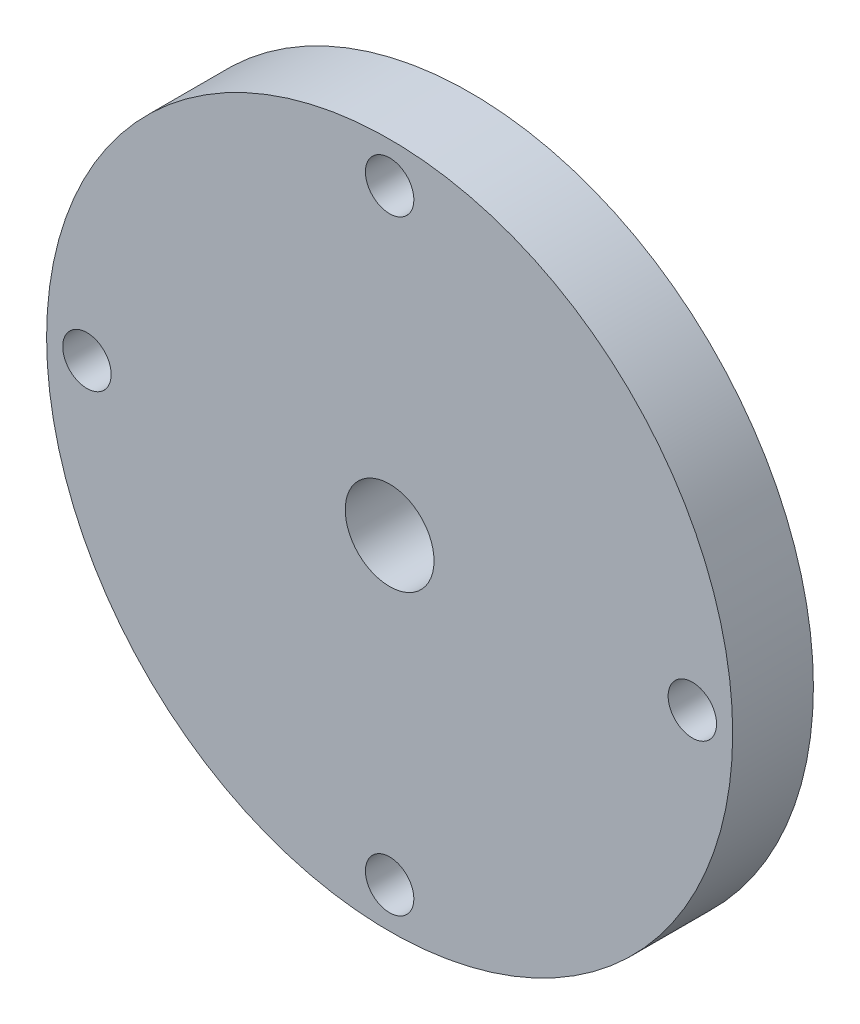
ISO-10303-21;
HEADER;
FILE_DESCRIPTION(('STEP AP214'),'2;1');
FILE_NAME('part.step','',(''),(''),'','','');
FILE_SCHEMA(('AUTOMOTIVE_DESIGN { 1 0 10303 214 1 1 1 1 }'));
ENDSEC;
DATA;
#1=APPLICATION_CONTEXT('core data for automotive mechanical design processes');
#2=APPLICATION_PROTOCOL_DEFINITION('international standard','automotive_design',2000,#1);
#3=PRODUCT_CONTEXT('',#1,'mechanical');
#4=PRODUCT('Part','Part','',(#3));
#5=PRODUCT_RELATED_PRODUCT_CATEGORY('part','',(#4));
#6=PRODUCT_DEFINITION_FORMATION('','',#4);
#7=PRODUCT_DEFINITION_CONTEXT('part definition',#1,'design');
#8=PRODUCT_DEFINITION('design','',#6,#7);
#9=PRODUCT_DEFINITION_SHAPE('','',#8);
#10=(LENGTH_UNIT() NAMED_UNIT(*) SI_UNIT(.MILLI.,.METRE.));
#11=(NAMED_UNIT(*) PLANE_ANGLE_UNIT() SI_UNIT($,.RADIAN.));
#12=(NAMED_UNIT(*) SI_UNIT($,.STERADIAN.) SOLID_ANGLE_UNIT());
#13=UNCERTAINTY_MEASURE_WITH_UNIT(LENGTH_MEASURE(1.E-05),#10,'distance_accuracy_value','');
#14=(GEOMETRIC_REPRESENTATION_CONTEXT(3) GLOBAL_UNCERTAINTY_ASSIGNED_CONTEXT((#13)) GLOBAL_UNIT_ASSIGNED_CONTEXT((#10,
#11,#12)) REPRESENTATION_CONTEXT('',''));
#15=CARTESIAN_POINT('',(0.,0.,0.));
#16=DIRECTION('',(0.,0.,1.));
#17=DIRECTION('',(1.,0.,0.));
#18=AXIS2_PLACEMENT_3D('',#15,#16,#17);
#19=CARTESIAN_POINT('',(0.,0.,1.));
#20=DIRECTION('',(0.,0.,1.));
#21=DIRECTION('',(1.,0.,0.));
#22=AXIS2_PLACEMENT_3D('',#19,#20,#21);
#23=PLANE('',#22);
#24=CARTESIAN_POINT('',(2.1224433562867E-13,-3.75,1.));
#25=DIRECTION('',(0.,0.,1.));
#26=DIRECTION('',(1.,0.,0.));
#27=AXIS2_PLACEMENT_3D('',#24,#25,#26);
#28=CIRCLE('',#27,0.300000000000228);
#29=CARTESIAN_POINT('',(0.30000000000044,-3.75,1.));
#30=VERTEX_POINT('',#29);
#31=EDGE_CURVE('E59',#30,#30,#28,.T.);
#32=ORIENTED_EDGE('',*,*,#31,.F.);
#33=EDGE_LOOP('',(#32));
#34=FACE_BOUND('',#33,.T.);
#35=CARTESIAN_POINT('',(0.,0.,1.));
#36=DIRECTION('',(0.,0.,1.));
#37=DIRECTION('',(1.,0.,0.));
#38=AXIS2_PLACEMENT_3D('',#35,#36,#37);
#39=CIRCLE('',#38,0.55);
#40=CARTESIAN_POINT('',(0.55,0.,1.));
#41=VERTEX_POINT('',#40);
#42=EDGE_CURVE('E47',#41,#41,#39,.T.);
#43=ORIENTED_EDGE('',*,*,#42,.F.);
#44=EDGE_LOOP('',(#43));
#45=FACE_BOUND('',#44,.T.);
#46=CARTESIAN_POINT('',(0.,0.,1.));
#47=DIRECTION('',(0.,0.,1.));
#48=DIRECTION('',(1.,0.,0.));
#49=AXIS2_PLACEMENT_3D('',#46,#47,#48);
#50=CIRCLE('',#49,4.25);
#51=CARTESIAN_POINT('',(4.25,0.,1.));
#52=VERTEX_POINT('',#51);
#53=EDGE_CURVE('E10',#52,#52,#50,.T.);
#54=ORIENTED_EDGE('',*,*,#53,.T.);
#55=EDGE_LOOP('',(#54));
#56=FACE_BOUND('',#55,.T.);
#57=CARTESIAN_POINT('',(0.,3.75,1.));
#58=DIRECTION('',(0.,0.,1.));
#59=DIRECTION('',(1.,0.,0.));
#60=AXIS2_PLACEMENT_3D('',#57,#58,#59);
#61=CIRCLE('',#60,0.3);
#62=CARTESIAN_POINT('',(0.3,3.75,1.));
#63=VERTEX_POINT('',#62);
#64=EDGE_CURVE('E42',#63,#63,#61,.T.);
#65=ORIENTED_EDGE('',*,*,#64,.F.);
#66=EDGE_LOOP('',(#65));
#67=FACE_BOUND('',#66,.T.);
#68=CARTESIAN_POINT('',(3.75000000000011,1.06122167814335E-13,1.));
#69=DIRECTION('',(0.,0.,1.));
#70=DIRECTION('',(1.,0.,0.));
#71=AXIS2_PLACEMENT_3D('',#68,#69,#70);
#72=CIRCLE('',#71,0.300000000000083);
#73=CARTESIAN_POINT('',(4.05000000000019,1.06122167814335E-13,1.));
#74=VERTEX_POINT('',#73);
#75=EDGE_CURVE('E53',#74,#74,#72,.T.);
#76=ORIENTED_EDGE('',*,*,#75,.F.);
#77=EDGE_LOOP('',(#76));
#78=FACE_BOUND('',#77,.T.);
#79=CARTESIAN_POINT('',(-3.74999999999989,-1.06581410364015E-13,1.));
#80=DIRECTION('',(0.,0.,1.));
#81=DIRECTION('',(1.,0.,0.));
#82=AXIS2_PLACEMENT_3D('',#79,#80,#81);
#83=CIRCLE('',#82,0.300000000000171);
#84=CARTESIAN_POINT('',(-3.44999999999972,-1.06581410364015E-13,1.));
#85=VERTEX_POINT('',#84);
#86=EDGE_CURVE('E65',#85,#85,#83,.T.);
#87=ORIENTED_EDGE('',*,*,#86,.F.);
#88=EDGE_LOOP('',(#87));
#89=FACE_BOUND('',#88,.T.);
#90=ADVANCED_FACE('F31',(#34,#45,#56,#67,#78,#89),#23,.T.);
#91=CARTESIAN_POINT('',(0.,0.,0.));
#92=DIRECTION('',(0.,0.,1.));
#93=DIRECTION('',(1.,0.,0.));
#94=AXIS2_PLACEMENT_3D('',#91,#92,#93);
#95=PLANE('',#94);
#96=CARTESIAN_POINT('',(2.1224433562867E-13,-3.75,0.));
#97=DIRECTION('',(0.,0.,1.));
#98=DIRECTION('',(1.,0.,0.));
#99=AXIS2_PLACEMENT_3D('',#96,#97,#98);
#100=CIRCLE('',#99,0.300000000000228);
#101=CARTESIAN_POINT('',(0.30000000000044,-3.75,0.));
#102=VERTEX_POINT('',#101);
#103=EDGE_CURVE('E62',#102,#102,#100,.T.);
#104=ORIENTED_EDGE('',*,*,#103,.T.);
#105=EDGE_LOOP('',(#104));
#106=FACE_BOUND('',#105,.T.);
#107=CARTESIAN_POINT('',(0.,0.,0.));
#108=DIRECTION('',(0.,0.,1.));
#109=DIRECTION('',(1.,0.,0.));
#110=AXIS2_PLACEMENT_3D('',#107,#108,#109);
#111=CIRCLE('',#110,0.55);
#112=CARTESIAN_POINT('',(0.55,0.,0.));
#113=VERTEX_POINT('',#112);
#114=EDGE_CURVE('E50',#113,#113,#111,.T.);
#115=ORIENTED_EDGE('',*,*,#114,.T.);
#116=EDGE_LOOP('',(#115));
#117=FACE_BOUND('',#116,.T.);
#118=CARTESIAN_POINT('',(0.,0.,0.));
#119=DIRECTION('',(0.,0.,1.));
#120=DIRECTION('',(1.,0.,0.));
#121=AXIS2_PLACEMENT_3D('',#118,#119,#120);
#122=CIRCLE('',#121,4.25);
#123=CARTESIAN_POINT('',(4.25,0.,0.));
#124=VERTEX_POINT('',#123);
#125=EDGE_CURVE('E35',#124,#124,#122,.T.);
#126=ORIENTED_EDGE('',*,*,#125,.F.);
#127=EDGE_LOOP('',(#126));
#128=FACE_BOUND('',#127,.T.);
#129=CARTESIAN_POINT('',(0.,3.75,0.));
#130=DIRECTION('',(0.,0.,1.));
#131=DIRECTION('',(1.,0.,0.));
#132=AXIS2_PLACEMENT_3D('',#129,#130,#131);
#133=CIRCLE('',#132,0.3);
#134=CARTESIAN_POINT('',(0.3,3.75,0.));
#135=VERTEX_POINT('',#134);
#136=EDGE_CURVE('E44',#135,#135,#133,.T.);
#137=ORIENTED_EDGE('',*,*,#136,.T.);
#138=EDGE_LOOP('',(#137));
#139=FACE_BOUND('',#138,.T.);
#140=CARTESIAN_POINT('',(3.75000000000011,1.06122167814335E-13,0.));
#141=DIRECTION('',(0.,0.,1.));
#142=DIRECTION('',(1.,0.,0.));
#143=AXIS2_PLACEMENT_3D('',#140,#141,#142);
#144=CIRCLE('',#143,0.300000000000083);
#145=CARTESIAN_POINT('',(4.05000000000019,1.06122167814335E-13,0.));
#146=VERTEX_POINT('',#145);
#147=EDGE_CURVE('E56',#146,#146,#144,.T.);
#148=ORIENTED_EDGE('',*,*,#147,.T.);
#149=EDGE_LOOP('',(#148));
#150=FACE_BOUND('',#149,.T.);
#151=CARTESIAN_POINT('',(-3.74999999999989,-1.06581410364015E-13,0.));
#152=DIRECTION('',(0.,0.,1.));
#153=DIRECTION('',(1.,0.,0.));
#154=AXIS2_PLACEMENT_3D('',#151,#152,#153);
#155=CIRCLE('',#154,0.300000000000171);
#156=CARTESIAN_POINT('',(-3.44999999999972,-1.06581410364015E-13,0.));
#157=VERTEX_POINT('',#156);
#158=EDGE_CURVE('E68',#157,#157,#155,.T.);
#159=ORIENTED_EDGE('',*,*,#158,.T.);
#160=EDGE_LOOP('',(#159));
#161=FACE_BOUND('',#160,.T.);
#162=ADVANCED_FACE('F78',(#106,#117,#128,#139,#150,#161),#95,.F.);
#163=CARTESIAN_POINT('',(0.,0.,1.));
#164=DIRECTION('',(0.,0.,-1.));
#165=DIRECTION('',(-1.,0.,0.));
#166=AXIS2_PLACEMENT_3D('',#163,#164,#165);
#167=CYLINDRICAL_SURFACE('',#166,4.25);
#168=ORIENTED_EDGE('',*,*,#53,.F.);
#169=EDGE_LOOP('',(#168));
#170=FACE_BOUND('',#169,.T.);
#171=ORIENTED_EDGE('',*,*,#125,.T.);
#172=EDGE_LOOP('',(#171));
#173=FACE_BOUND('',#172,.T.);
#174=ADVANCED_FACE('F33',(#170,#173),#167,.T.);
#175=CARTESIAN_POINT('',(0.,3.75,1.));
#176=DIRECTION('',(0.,0.,-1.));
#177=DIRECTION('',(-1.,0.,0.));
#178=AXIS2_PLACEMENT_3D('',#175,#176,#177);
#179=CYLINDRICAL_SURFACE('',#178,0.3);
#180=ORIENTED_EDGE('',*,*,#64,.T.);
#181=EDGE_LOOP('',(#180));
#182=FACE_BOUND('',#181,.T.);
#183=ORIENTED_EDGE('',*,*,#136,.F.);
#184=EDGE_LOOP('',(#183));
#185=FACE_BOUND('',#184,.T.);
#186=ADVANCED_FACE('F88',(#182,#185),#179,.F.);
#187=CARTESIAN_POINT('',(0.,0.,1.));
#188=DIRECTION('',(0.,0.,-1.));
#189=DIRECTION('',(-1.,0.,0.));
#190=AXIS2_PLACEMENT_3D('',#187,#188,#189);
#191=CYLINDRICAL_SURFACE('',#190,0.55);
#192=ORIENTED_EDGE('',*,*,#42,.T.);
#193=EDGE_LOOP('',(#192));
#194=FACE_BOUND('',#193,.T.);
#195=ORIENTED_EDGE('',*,*,#114,.F.);
#196=EDGE_LOOP('',(#195));
#197=FACE_BOUND('',#196,.T.);
#198=ADVANCED_FACE('F91',(#194,#197),#191,.F.);
#199=CARTESIAN_POINT('',(3.75000000000011,1.06122167814335E-13,1.));
#200=DIRECTION('',(0.,0.,-1.));
#201=DIRECTION('',(-1.,0.,0.));
#202=AXIS2_PLACEMENT_3D('',#199,#200,#201);
#203=CYLINDRICAL_SURFACE('',#202,0.300000000000083);
#204=ORIENTED_EDGE('',*,*,#75,.T.);
#205=EDGE_LOOP('',(#204));
#206=FACE_BOUND('',#205,.T.);
#207=ORIENTED_EDGE('',*,*,#147,.F.);
#208=EDGE_LOOP('',(#207));
#209=FACE_BOUND('',#208,.T.);
#210=ADVANCED_FACE('F95',(#206,#209),#203,.F.);
#211=CARTESIAN_POINT('',(2.1224433562867E-13,-3.75,1.));
#212=DIRECTION('',(0.,0.,-1.));
#213=DIRECTION('',(-1.,0.,0.));
#214=AXIS2_PLACEMENT_3D('',#211,#212,#213);
#215=CYLINDRICAL_SURFACE('',#214,0.300000000000228);
#216=ORIENTED_EDGE('',*,*,#31,.T.);
#217=EDGE_LOOP('',(#216));
#218=FACE_BOUND('',#217,.T.);
#219=ORIENTED_EDGE('',*,*,#103,.F.);
#220=EDGE_LOOP('',(#219));
#221=FACE_BOUND('',#220,.T.);
#222=ADVANCED_FACE('F99',(#218,#221),#215,.F.);
#223=CARTESIAN_POINT('',(-3.74999999999989,-1.06581410364015E-13,1.));
#224=DIRECTION('',(0.,0.,-1.));
#225=DIRECTION('',(-1.,0.,0.));
#226=AXIS2_PLACEMENT_3D('',#223,#224,#225);
#227=CYLINDRICAL_SURFACE('',#226,0.300000000000171);
#228=ORIENTED_EDGE('',*,*,#86,.T.);
#229=EDGE_LOOP('',(#228));
#230=FACE_BOUND('',#229,.T.);
#231=ORIENTED_EDGE('',*,*,#158,.F.);
#232=EDGE_LOOP('',(#231));
#233=FACE_BOUND('',#232,.T.);
#234=ADVANCED_FACE('F74',(#230,#233),#227,.F.);
#235=CLOSED_SHELL('',(#90,#162,#174,#186,#198,#210,#222,#234));
#236=MANIFOLD_SOLID_BREP('B2',#235);
#237=ADVANCED_BREP_SHAPE_REPRESENTATION('',(#18,#236),#14);
#238=SHAPE_DEFINITION_REPRESENTATION(#9,#237);
ENDSEC;
END-ISO-10303-21;
